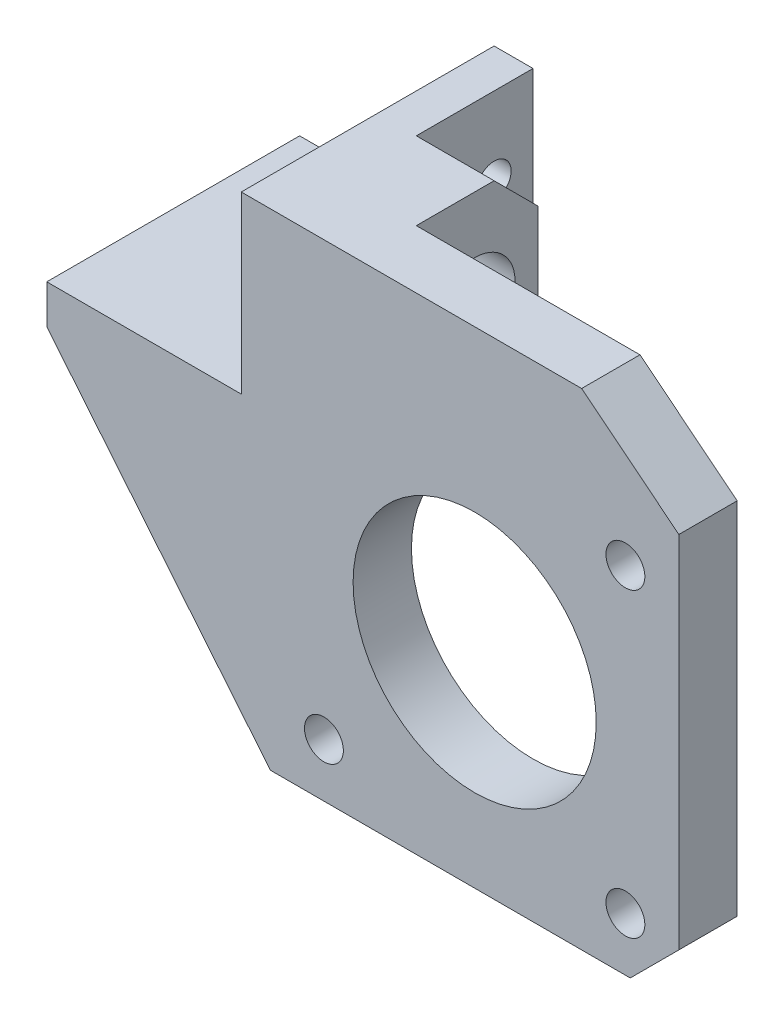
ISO-10303-21;
HEADER;
FILE_DESCRIPTION(('STEP AP214'),'2;1');
FILE_NAME('part.step','',(''),(''),'','','');
FILE_SCHEMA(('AUTOMOTIVE_DESIGN { 1 0 10303 214 1 1 1 1 }'));
ENDSEC;
DATA;
#1=APPLICATION_CONTEXT('core data for automotive mechanical design processes');
#2=APPLICATION_PROTOCOL_DEFINITION('international standard','automotive_design',2000,#1);
#3=PRODUCT_CONTEXT('',#1,'mechanical');
#4=PRODUCT('Part','Part','',(#3));
#5=PRODUCT_RELATED_PRODUCT_CATEGORY('part','',(#4));
#6=PRODUCT_DEFINITION_FORMATION('','',#4);
#7=PRODUCT_DEFINITION_CONTEXT('part definition',#1,'design');
#8=PRODUCT_DEFINITION('design','',#6,#7);
#9=PRODUCT_DEFINITION_SHAPE('','',#8);
#10=(LENGTH_UNIT() NAMED_UNIT(*) SI_UNIT(.MILLI.,.METRE.));
#11=(NAMED_UNIT(*) PLANE_ANGLE_UNIT() SI_UNIT($,.RADIAN.));
#12=(NAMED_UNIT(*) SI_UNIT($,.STERADIAN.) SOLID_ANGLE_UNIT());
#13=UNCERTAINTY_MEASURE_WITH_UNIT(LENGTH_MEASURE(1.E-05),#10,'distance_accuracy_value','');
#14=(GEOMETRIC_REPRESENTATION_CONTEXT(3) GLOBAL_UNCERTAINTY_ASSIGNED_CONTEXT((#13)) GLOBAL_UNIT_ASSIGNED_CONTEXT((#10,
#11,#12)) REPRESENTATION_CONTEXT('',''));
#15=CARTESIAN_POINT('',(0.,0.,0.));
#16=DIRECTION('',(0.,0.,1.));
#17=DIRECTION('',(1.,0.,0.));
#18=AXIS2_PLACEMENT_3D('',#15,#16,#17);
#19=CARTESIAN_POINT('',(-34.5,19.,-13.));
#20=DIRECTION('',(0.,-1.,0.));
#21=DIRECTION('',(1.,0.,0.));
#22=AXIS2_PLACEMENT_3D('',#19,#20,#21);
#23=CYLINDRICAL_SURFACE('',#22,1.75);
#24=CARTESIAN_POINT('',(-34.5,6.99999999999996,-13.));
#25=DIRECTION('',(0.,-1.,0.));
#26=DIRECTION('',(1.,0.,0.));
#27=AXIS2_PLACEMENT_3D('',#24,#25,#26);
#28=CIRCLE('',#27,1.75);
#29=CARTESIAN_POINT('',(-32.75,6.99999999999996,-13.));
#30=VERTEX_POINT('',#29);
#31=EDGE_CURVE('E304',#30,#30,#28,.T.);
#32=ORIENTED_EDGE('',*,*,#31,.T.);
#33=EDGE_LOOP('',(#32));
#34=FACE_BOUND('',#33,.T.);
#35=CARTESIAN_POINT('',(-34.5,9.99999999999995,-13.));
#36=DIRECTION('',(0.,1.,0.));
#37=DIRECTION('',(-1.,0.,0.));
#38=AXIS2_PLACEMENT_3D('',#35,#36,#37);
#39=CIRCLE('',#38,1.75);
#40=CARTESIAN_POINT('',(-36.25,9.99999999999995,-13.));
#41=VERTEX_POINT('',#40);
#42=EDGE_CURVE('E37',#41,#41,#39,.F.);
#43=ORIENTED_EDGE('',*,*,#42,.F.);
#44=EDGE_LOOP('',(#43));
#45=FACE_BOUND('',#44,.T.);
#46=ADVANCED_FACE('F33',(#34,#45),#23,.F.);
#47=CARTESIAN_POINT('',(-32.,21.,-16.));
#48=DIRECTION('',(1.,0.,0.));
#49=DIRECTION('',(0.,1.,0.));
#50=AXIS2_PLACEMENT_3D('',#47,#48,#49);
#51=CYLINDRICAL_SURFACE('',#50,1.75);
#52=CARTESIAN_POINT('',(-20.,21.,-16.));
#53=DIRECTION('',(1.,0.,0.));
#54=DIRECTION('',(0.,1.,0.));
#55=AXIS2_PLACEMENT_3D('',#52,#53,#54);
#56=CIRCLE('',#55,1.75);
#57=CARTESIAN_POINT('',(-20.,22.75,-16.));
#58=VERTEX_POINT('',#57);
#59=EDGE_CURVE('E303',#58,#58,#56,.T.);
#60=ORIENTED_EDGE('',*,*,#59,.T.);
#61=EDGE_LOOP('',(#60));
#62=FACE_BOUND('',#61,.T.);
#63=CARTESIAN_POINT('',(-23.,21.,-16.));
#64=DIRECTION('',(-1.,0.,0.));
#65=DIRECTION('',(0.,0.,1.));
#66=AXIS2_PLACEMENT_3D('',#63,#64,#65);
#67=CIRCLE('',#66,1.75);
#68=CARTESIAN_POINT('',(-23.,21.,-14.25));
#69=VERTEX_POINT('',#68);
#70=EDGE_CURVE('E311',#69,#69,#67,.F.);
#71=ORIENTED_EDGE('',*,*,#70,.F.);
#72=EDGE_LOOP('',(#71));
#73=FACE_BOUND('',#72,.T.);
#74=ADVANCED_FACE('F458',(#62,#73),#51,.F.);
#75=CARTESIAN_POINT('',(0.,0.,0.));
#76=DIRECTION('',(0.,0.,-1.));
#77=DIRECTION('',(-1.,0.,0.));
#78=AXIS2_PLACEMENT_3D('',#75,#76,#77);
#79=PLANE('',#78);
#80=CARTESIAN_POINT('',(15.4999999999999,-15.5,0.));
#81=DIRECTION('',(0.,0.,1.));
#82=DIRECTION('',(-1.,0.,0.));
#83=AXIS2_PLACEMENT_3D('',#80,#81,#82);
#84=CIRCLE('',#83,2.);
#85=CARTESIAN_POINT('',(13.4999999999999,-15.5,0.));
#86=VERTEX_POINT('',#85);
#87=EDGE_CURVE('E234',#86,#86,#84,.T.);
#88=ORIENTED_EDGE('',*,*,#87,.T.);
#89=EDGE_LOOP('',(#88));
#90=FACE_BOUND('',#89,.T.);
#91=CARTESIAN_POINT('',(0.,0.,0.));
#92=DIRECTION('',(0.,0.,1.));
#93=DIRECTION('',(1.,0.,0.));
#94=AXIS2_PLACEMENT_3D('',#91,#92,#93);
#95=CIRCLE('',#94,12.5);
#96=CARTESIAN_POINT('',(12.5,0.,0.));
#97=VERTEX_POINT('',#96);
#98=EDGE_CURVE('E246',#97,#97,#95,.T.);
#99=ORIENTED_EDGE('',*,*,#98,.T.);
#100=EDGE_LOOP('',(#99));
#101=FACE_BOUND('',#100,.T.);
#102=CARTESIAN_POINT('',(15.4999999999999,15.5,0.));
#103=DIRECTION('',(0.,0.,1.));
#104=DIRECTION('',(-1.,0.,0.));
#105=AXIS2_PLACEMENT_3D('',#102,#103,#104);
#106=CIRCLE('',#105,2.);
#107=CARTESIAN_POINT('',(13.4999999999999,15.5,0.));
#108=VERTEX_POINT('',#107);
#109=EDGE_CURVE('E240',#108,#108,#106,.T.);
#110=ORIENTED_EDGE('',*,*,#109,.T.);
#111=EDGE_LOOP('',(#110));
#112=FACE_BOUND('',#111,.T.);
#113=CARTESIAN_POINT('',(-15.5,-15.5,0.));
#114=DIRECTION('',(0.,0.,1.));
#115=DIRECTION('',(-1.,0.,0.));
#116=AXIS2_PLACEMENT_3D('',#113,#114,#115);
#117=CIRCLE('',#116,2.);
#118=CARTESIAN_POINT('',(-17.5,-15.5,0.));
#119=VERTEX_POINT('',#118);
#120=EDGE_CURVE('E230',#119,#119,#117,.T.);
#121=ORIENTED_EDGE('',*,*,#120,.T.);
#122=EDGE_LOOP('',(#121));
#123=FACE_BOUND('',#122,.T.);
#124=DIRECTION('',(0.,1.,0.));
#125=VECTOR('',#124,1.);
#126=CARTESIAN_POINT('',(21.,-21.,0.));
#127=LINE('',#126,#125);
#128=CARTESIAN_POINT('',(21.,-16.,0.));
#129=VERTEX_POINT('',#128);
#130=CARTESIAN_POINT('',(21.,21.,0.));
#131=VERTEX_POINT('',#130);
#132=EDGE_CURVE('E277',#129,#131,#127,.T.);
#133=ORIENTED_EDGE('',*,*,#132,.F.);
#134=DIRECTION('',(0.707106781186548,0.707106781186547,0.));
#135=VECTOR('',#134,1.);
#136=CARTESIAN_POINT('',(18.5,-18.5,0.));
#137=LINE('',#136,#135);
#138=CARTESIAN_POINT('',(16.,-21.,0.));
#139=VERTEX_POINT('',#138);
#140=EDGE_CURVE('E307',#129,#139,#137,.F.);
#141=ORIENTED_EDGE('',*,*,#140,.T.);
#142=DIRECTION('',(1.,0.,0.));
#143=VECTOR('',#142,1.);
#144=CARTESIAN_POINT('',(-21.,-21.,0.));
#145=LINE('',#144,#143);
#146=CARTESIAN_POINT('',(-21.,-21.,0.));
#147=VERTEX_POINT('',#146);
#148=EDGE_CURVE('E275',#147,#139,#145,.T.);
#149=ORIENTED_EDGE('',*,*,#148,.F.);
#150=DIRECTION('',(0.634739423360014,-0.772726254525234,0.));
#151=VECTOR('',#150,1.);
#152=CARTESIAN_POINT('',(-44.,6.99999999999996,0.));
#153=LINE('',#152,#151);
#154=CARTESIAN_POINT('',(-44.,6.99999999999996,0.));
#155=VERTEX_POINT('',#154);
#156=EDGE_CURVE('E252',#155,#147,#153,.T.);
#157=ORIENTED_EDGE('',*,*,#156,.F.);
#158=DIRECTION('',(-1.,0.,0.));
#159=VECTOR('',#158,1.);
#160=CARTESIAN_POINT('',(-44.,6.99999999999997,0.));
#161=LINE('',#160,#159);
#162=CARTESIAN_POINT('',(-24.,6.99999999999996,0.));
#163=VERTEX_POINT('',#162);
#164=EDGE_CURVE('E197',#163,#155,#161,.T.);
#165=ORIENTED_EDGE('',*,*,#164,.F.);
#166=CARTESIAN_POINT('',(-24.,11.,0.));
#167=DIRECTION('',(0.,0.,-1.));
#168=DIRECTION('',(-1.,0.,0.));
#169=AXIS2_PLACEMENT_3D('',#166,#167,#168);
#170=CIRCLE('',#169,3.99999999999999);
#171=CARTESIAN_POINT('',(-20.,11.,0.));
#172=VERTEX_POINT('',#171);
#173=EDGE_CURVE('E212',#172,#163,#170,.T.);
#174=ORIENTED_EDGE('',*,*,#173,.F.);
#175=DIRECTION('',(0.,-1.,0.));
#176=VECTOR('',#175,1.);
#177=CARTESIAN_POINT('',(-20.,9.,0.));
#178=LINE('',#177,#176);
#179=CARTESIAN_POINT('',(-20.,9.,0.));
#180=VERTEX_POINT('',#179);
#181=EDGE_CURVE('E328',#172,#180,#178,.T.);
#182=ORIENTED_EDGE('',*,*,#181,.T.);
#183=DIRECTION('',(-1.,0.,0.));
#184=VECTOR('',#183,1.);
#185=CARTESIAN_POINT('',(-12.,9.,0.));
#186=LINE('',#185,#184);
#187=CARTESIAN_POINT('',(-12.,9.,0.));
#188=VERTEX_POINT('',#187);
#189=EDGE_CURVE('E215',#188,#180,#186,.T.);
#190=ORIENTED_EDGE('',*,*,#189,.F.);
#191=DIRECTION('',(0.,-1.,0.));
#192=VECTOR('',#191,1.);
#193=CARTESIAN_POINT('',(-12.,9.,0.));
#194=LINE('',#193,#192);
#195=CARTESIAN_POINT('',(-12.,29.,0.));
#196=VERTEX_POINT('',#195);
#197=EDGE_CURVE('E329',#196,#188,#194,.T.);
#198=ORIENTED_EDGE('',*,*,#197,.F.);
#199=DIRECTION('',(-1.,0.,0.));
#200=VECTOR('',#199,1.);
#201=CARTESIAN_POINT('',(-24.,29.,0.));
#202=LINE('',#201,#200);
#203=CARTESIAN_POINT('',(11.,29.,0.));
#204=VERTEX_POINT('',#203);
#205=EDGE_CURVE('E259',#204,#196,#202,.T.);
#206=ORIENTED_EDGE('',*,*,#205,.F.);
#207=DIRECTION('',(-0.780868809443029,0.624695047554426,0.));
#208=VECTOR('',#207,1.);
#209=CARTESIAN_POINT('',(11.,29.,0.));
#210=LINE('',#209,#208);
#211=EDGE_CURVE('E279',#131,#204,#210,.T.);
#212=ORIENTED_EDGE('',*,*,#211,.F.);
#213=EDGE_LOOP('',(#133,#141,#149,#157,#165,#174,#182,#190,#198,#206,#212));
#214=FACE_BOUND('',#213,.T.);
#215=ADVANCED_FACE('F374',(#90,#101,#112,#123,#214),#79,.T.);
#216=CARTESIAN_POINT('',(0.,0.,6.));
#217=DIRECTION('',(0.,0.,-1.));
#218=DIRECTION('',(-1.,0.,0.));
#219=AXIS2_PLACEMENT_3D('',#216,#217,#218);
#220=PLANE('',#219);
#221=DIRECTION('',(1.,0.,0.));
#222=VECTOR('',#221,1.);
#223=CARTESIAN_POINT('',(-21.,-21.,6.));
#224=LINE('',#223,#222);
#225=CARTESIAN_POINT('',(-21.,-21.,6.));
#226=VERTEX_POINT('',#225);
#227=CARTESIAN_POINT('',(16.,-21.,6.));
#228=VERTEX_POINT('',#227);
#229=EDGE_CURVE('E265',#226,#228,#224,.T.);
#230=ORIENTED_EDGE('',*,*,#229,.T.);
#231=DIRECTION('',(-0.707106781186548,-0.707106781186547,0.));
#232=VECTOR('',#231,1.);
#233=CARTESIAN_POINT('',(21.,-16.,6.));
#234=LINE('',#233,#232);
#235=CARTESIAN_POINT('',(21.,-16.,6.));
#236=VERTEX_POINT('',#235);
#237=EDGE_CURVE('E186',#228,#236,#234,.F.);
#238=ORIENTED_EDGE('',*,*,#237,.T.);
#239=DIRECTION('',(0.,1.,0.));
#240=VECTOR('',#239,1.);
#241=CARTESIAN_POINT('',(21.,-21.,6.));
#242=LINE('',#241,#240);
#243=CARTESIAN_POINT('',(21.,21.,6.));
#244=VERTEX_POINT('',#243);
#245=EDGE_CURVE('E267',#236,#244,#242,.T.);
#246=ORIENTED_EDGE('',*,*,#245,.T.);
#247=DIRECTION('',(-0.780868809443029,0.624695047554426,0.));
#248=VECTOR('',#247,1.);
#249=CARTESIAN_POINT('',(11.,29.,6.));
#250=LINE('',#249,#248);
#251=CARTESIAN_POINT('',(11.,29.,6.));
#252=VERTEX_POINT('',#251);
#253=EDGE_CURVE('E269',#244,#252,#250,.T.);
#254=ORIENTED_EDGE('',*,*,#253,.T.);
#255=DIRECTION('',(-1.,0.,0.));
#256=VECTOR('',#255,1.);
#257=CARTESIAN_POINT('',(-24.,29.,6.));
#258=LINE('',#257,#256);
#259=CARTESIAN_POINT('',(-24.,29.,6.));
#260=VERTEX_POINT('',#259);
#261=EDGE_CURVE('E271',#252,#260,#258,.T.);
#262=ORIENTED_EDGE('',*,*,#261,.T.);
#263=DIRECTION('',(0.,-1.,0.));
#264=VECTOR('',#263,1.);
#265=CARTESIAN_POINT('',(-24.,11.,6.));
#266=LINE('',#265,#264);
#267=CARTESIAN_POINT('',(-24.,11.,6.));
#268=VERTEX_POINT('',#267);
#269=EDGE_CURVE('E255',#260,#268,#266,.T.);
#270=ORIENTED_EDGE('',*,*,#269,.T.);
#271=DIRECTION('',(-1.,0.,0.));
#272=VECTOR('',#271,1.);
#273=CARTESIAN_POINT('',(-24.,11.,6.));
#274=LINE('',#273,#272);
#275=CARTESIAN_POINT('',(-44.,10.9999999999999,6.));
#276=VERTEX_POINT('',#275);
#277=EDGE_CURVE('E258',#268,#276,#274,.T.);
#278=ORIENTED_EDGE('',*,*,#277,.T.);
#279=DIRECTION('',(0.,-1.,0.));
#280=VECTOR('',#279,1.);
#281=CARTESIAN_POINT('',(-44.,10.9999999999999,6.));
#282=LINE('',#281,#280);
#283=CARTESIAN_POINT('',(-44.,6.99999999999996,6.));
#284=VERTEX_POINT('',#283);
#285=EDGE_CURVE('E261',#276,#284,#282,.T.);
#286=ORIENTED_EDGE('',*,*,#285,.T.);
#287=DIRECTION('',(0.634739423360014,-0.772726254525234,0.));
#288=VECTOR('',#287,1.);
#289=CARTESIAN_POINT('',(-44.,6.99999999999996,6.));
#290=LINE('',#289,#288);
#291=EDGE_CURVE('E263',#284,#226,#290,.T.);
#292=ORIENTED_EDGE('',*,*,#291,.T.);
#293=EDGE_LOOP('',(#230,#238,#246,#254,#262,#270,#278,#286,#292));
#294=FACE_BOUND('',#293,.T.);
#295=CARTESIAN_POINT('',(0.,0.,6.));
#296=DIRECTION('',(0.,0.,1.));
#297=DIRECTION('',(1.,0.,0.));
#298=AXIS2_PLACEMENT_3D('',#295,#296,#297);
#299=CIRCLE('',#298,12.5);
#300=CARTESIAN_POINT('',(12.5,0.,6.));
#301=VERTEX_POINT('',#300);
#302=EDGE_CURVE('E249',#301,#301,#299,.T.);
#303=ORIENTED_EDGE('',*,*,#302,.F.);
#304=EDGE_LOOP('',(#303));
#305=FACE_BOUND('',#304,.T.);
#306=CARTESIAN_POINT('',(15.4999999999999,15.5,6.));
#307=DIRECTION('',(0.,0.,1.));
#308=DIRECTION('',(-1.,0.,0.));
#309=AXIS2_PLACEMENT_3D('',#306,#307,#308);
#310=CIRCLE('',#309,2.);
#311=CARTESIAN_POINT('',(13.4999999999999,15.5,6.));
#312=VERTEX_POINT('',#311);
#313=EDGE_CURVE('E243',#312,#312,#310,.T.);
#314=ORIENTED_EDGE('',*,*,#313,.F.);
#315=EDGE_LOOP('',(#314));
#316=FACE_BOUND('',#315,.T.);
#317=CARTESIAN_POINT('',(15.4999999999999,-15.5,6.));
#318=DIRECTION('',(0.,0.,1.));
#319=DIRECTION('',(-1.,0.,0.));
#320=AXIS2_PLACEMENT_3D('',#317,#318,#319);
#321=CIRCLE('',#320,2.);
#322=CARTESIAN_POINT('',(13.4999999999999,-15.5,6.));
#323=VERTEX_POINT('',#322);
#324=EDGE_CURVE('E237',#323,#323,#321,.T.);
#325=ORIENTED_EDGE('',*,*,#324,.F.);
#326=EDGE_LOOP('',(#325));
#327=FACE_BOUND('',#326,.T.);
#328=CARTESIAN_POINT('',(-15.5,-15.5,6.));
#329=DIRECTION('',(0.,0.,1.));
#330=DIRECTION('',(-1.,0.,0.));
#331=AXIS2_PLACEMENT_3D('',#328,#329,#330);
#332=CIRCLE('',#331,2.);
#333=CARTESIAN_POINT('',(-17.5,-15.5,6.));
#334=VERTEX_POINT('',#333);
#335=EDGE_CURVE('E231',#334,#334,#332,.T.);
#336=ORIENTED_EDGE('',*,*,#335,.F.);
#337=EDGE_LOOP('',(#336));
#338=FACE_BOUND('',#337,.T.);
#339=ADVANCED_FACE('F422',(#294,#305,#316,#327,#338),#220,.F.);
#340=CARTESIAN_POINT('',(-24.,11.,6.));
#341=DIRECTION('',(0.,-1.,0.));
#342=DIRECTION('',(1.,0.,0.));
#343=AXIS2_PLACEMENT_3D('',#340,#341,#342);
#344=PLANE('',#343);
#345=CARTESIAN_POINT('',(-34.5,10.9999999999999,-13.));
#346=DIRECTION('',(0.,1.,0.));
#347=DIRECTION('',(-1.,0.,0.));
#348=AXIS2_PLACEMENT_3D('',#345,#346,#347);
#349=CIRCLE('',#348,5.25);
#350=CARTESIAN_POINT('',(-39.75,10.9999999999999,-13.));
#351=VERTEX_POINT('',#350);
#352=EDGE_CURVE('E318',#351,#351,#349,.T.);
#353=ORIENTED_EDGE('',*,*,#352,.F.);
#354=EDGE_LOOP('',(#353));
#355=FACE_BOUND('',#354,.T.);
#356=DIRECTION('',(0.,0.,-1.));
#357=VECTOR('',#356,1.);
#358=CARTESIAN_POINT('',(-24.,11.,6.));
#359=LINE('',#358,#357);
#360=CARTESIAN_POINT('',(-24.,11.,-20.));
#361=VERTEX_POINT('',#360);
#362=EDGE_CURVE('E297',#268,#361,#359,.T.);
#363=ORIENTED_EDGE('',*,*,#362,.T.);
#364=DIRECTION('',(1.,0.,0.));
#365=VECTOR('',#364,1.);
#366=CARTESIAN_POINT('',(-24.,11.,-20.));
#367=LINE('',#366,#365);
#368=CARTESIAN_POINT('',(-44.,11.,-20.));
#369=VERTEX_POINT('',#368);
#370=EDGE_CURVE('E193',#369,#361,#367,.T.);
#371=ORIENTED_EDGE('',*,*,#370,.F.);
#372=DIRECTION('',(0.,0.,-1.));
#373=VECTOR('',#372,1.);
#374=CARTESIAN_POINT('',(-44.,10.9999999999999,6.));
#375=LINE('',#374,#373);
#376=EDGE_CURVE('E295',#276,#369,#375,.T.);
#377=ORIENTED_EDGE('',*,*,#376,.F.);
#378=ORIENTED_EDGE('',*,*,#277,.F.);
#379=EDGE_LOOP('',(#363,#371,#377,#378));
#380=FACE_BOUND('',#379,.T.);
#381=ADVANCED_FACE('F441',(#355,#380),#344,.F.);
#382=CARTESIAN_POINT('',(-44.,10.9999999999999,6.));
#383=DIRECTION('',(1.,0.,0.));
#384=DIRECTION('',(0.,0.,-1.));
#385=AXIS2_PLACEMENT_3D('',#382,#383,#384);
#386=PLANE('',#385);
#387=ORIENTED_EDGE('',*,*,#376,.T.);
#388=DIRECTION('',(0.,1.,0.));
#389=VECTOR('',#388,1.);
#390=CARTESIAN_POINT('',(-44.,11.,-20.));
#391=LINE('',#390,#389);
#392=CARTESIAN_POINT('',(-44.,6.99999999999997,-20.));
#393=VERTEX_POINT('',#392);
#394=EDGE_CURVE('E208',#393,#369,#391,.T.);
#395=ORIENTED_EDGE('',*,*,#394,.F.);
#396=DIRECTION('',(0.,0.,1.));
#397=VECTOR('',#396,1.);
#398=CARTESIAN_POINT('',(-44.,6.99999999999997,-20.));
#399=LINE('',#398,#397);
#400=EDGE_CURVE('E211',#393,#155,#399,.T.);
#401=ORIENTED_EDGE('',*,*,#400,.T.);
#402=DIRECTION('',(0.,0.,-1.));
#403=VECTOR('',#402,1.);
#404=CARTESIAN_POINT('',(-44.,6.99999999999996,6.));
#405=LINE('',#404,#403);
#406=EDGE_CURVE('E293',#284,#155,#405,.T.);
#407=ORIENTED_EDGE('',*,*,#406,.F.);
#408=ORIENTED_EDGE('',*,*,#285,.F.);
#409=EDGE_LOOP('',(#387,#395,#401,#407,#408));
#410=FACE_BOUND('',#409,.T.);
#411=ADVANCED_FACE('F436',(#410),#386,.F.);
#412=CARTESIAN_POINT('',(-44.,6.99999999999996,6.));
#413=DIRECTION('',(0.772726254525234,0.634739423360014,0.));
#414=DIRECTION('',(-0.634739423360014,0.772726254525234,0.));
#415=AXIS2_PLACEMENT_3D('',#412,#413,#414);
#416=PLANE('',#415);
#417=ORIENTED_EDGE('',*,*,#156,.T.);
#418=DIRECTION('',(0.,0.,-1.));
#419=VECTOR('',#418,1.);
#420=CARTESIAN_POINT('',(-21.,-21.,6.));
#421=LINE('',#420,#419);
#422=EDGE_CURVE('E290',#226,#147,#421,.T.);
#423=ORIENTED_EDGE('',*,*,#422,.F.);
#424=ORIENTED_EDGE('',*,*,#291,.F.);
#425=ORIENTED_EDGE('',*,*,#406,.T.);
#426=EDGE_LOOP('',(#417,#423,#424,#425));
#427=FACE_BOUND('',#426,.T.);
#428=ADVANCED_FACE('F521',(#427),#416,.F.);
#429=CARTESIAN_POINT('',(-21.,-21.,6.));
#430=DIRECTION('',(0.,1.,0.));
#431=DIRECTION('',(0.,0.,1.));
#432=AXIS2_PLACEMENT_3D('',#429,#430,#431);
#433=PLANE('',#432);
#434=ORIENTED_EDGE('',*,*,#148,.T.);
#435=DIRECTION('',(0.,0.,1.));
#436=VECTOR('',#435,1.);
#437=CARTESIAN_POINT('',(16.,-21.,6.));
#438=LINE('',#437,#436);
#439=EDGE_CURVE('E56',#139,#228,#438,.T.);
#440=ORIENTED_EDGE('',*,*,#439,.T.);
#441=ORIENTED_EDGE('',*,*,#229,.F.);
#442=ORIENTED_EDGE('',*,*,#422,.T.);
#443=EDGE_LOOP('',(#434,#440,#441,#442));
#444=FACE_BOUND('',#443,.T.);
#445=ADVANCED_FACE('F426',(#444),#433,.F.);
#446=CARTESIAN_POINT('',(21.,-21.,6.));
#447=DIRECTION('',(-1.,0.,0.));
#448=DIRECTION('',(0.,-1.,0.));
#449=AXIS2_PLACEMENT_3D('',#446,#447,#448);
#450=PLANE('',#449);
#451=ORIENTED_EDGE('',*,*,#245,.F.);
#452=DIRECTION('',(0.,0.,-1.));
#453=VECTOR('',#452,1.);
#454=CARTESIAN_POINT('',(21.,-16.,6.));
#455=LINE('',#454,#453);
#456=EDGE_CURVE('E299',#236,#129,#455,.T.);
#457=ORIENTED_EDGE('',*,*,#456,.T.);
#458=ORIENTED_EDGE('',*,*,#132,.T.);
#459=DIRECTION('',(0.,0.,-1.));
#460=VECTOR('',#459,1.);
#461=CARTESIAN_POINT('',(21.,21.,6.));
#462=LINE('',#461,#460);
#463=EDGE_CURVE('E287',#244,#131,#462,.T.);
#464=ORIENTED_EDGE('',*,*,#463,.F.);
#465=EDGE_LOOP('',(#451,#457,#458,#464));
#466=FACE_BOUND('',#465,.T.);
#467=ADVANCED_FACE('F417',(#466),#450,.F.);
#468=CARTESIAN_POINT('',(11.,29.,6.));
#469=DIRECTION('',(-0.624695047554426,-0.780868809443029,0.));
#470=DIRECTION('',(0.780868809443029,-0.624695047554426,0.));
#471=AXIS2_PLACEMENT_3D('',#468,#469,#470);
#472=PLANE('',#471);
#473=ORIENTED_EDGE('',*,*,#211,.T.);
#474=DIRECTION('',(0.,0.,-1.));
#475=VECTOR('',#474,1.);
#476=CARTESIAN_POINT('',(11.,29.,6.));
#477=LINE('',#476,#475);
#478=EDGE_CURVE('E284',#252,#204,#477,.T.);
#479=ORIENTED_EDGE('',*,*,#478,.F.);
#480=ORIENTED_EDGE('',*,*,#253,.F.);
#481=ORIENTED_EDGE('',*,*,#463,.T.);
#482=EDGE_LOOP('',(#473,#479,#480,#481));
#483=FACE_BOUND('',#482,.T.);
#484=ADVANCED_FACE('F412',(#483),#472,.F.);
#485=CARTESIAN_POINT('',(-24.,29.,6.));
#486=DIRECTION('',(0.,-1.,0.));
#487=DIRECTION('',(1.,0.,0.));
#488=AXIS2_PLACEMENT_3D('',#485,#486,#487);
#489=PLANE('',#488);
#490=ORIENTED_EDGE('',*,*,#205,.T.);
#491=DIRECTION('',(0.,0.,1.));
#492=VECTOR('',#491,1.);
#493=CARTESIAN_POINT('',(-12.,29.,0.));
#494=LINE('',#493,#492);
#495=CARTESIAN_POINT('',(-12.,29.,-8.));
#496=VERTEX_POINT('',#495);
#497=EDGE_CURVE('E341',#496,#196,#494,.T.);
#498=ORIENTED_EDGE('',*,*,#497,.F.);
#499=DIRECTION('',(-1.,0.,0.));
#500=VECTOR('',#499,1.);
#501=CARTESIAN_POINT('',(-12.,29.,-8.));
#502=LINE('',#501,#500);
#503=CARTESIAN_POINT('',(-20.,29.,-8.));
#504=VERTEX_POINT('',#503);
#505=EDGE_CURVE('E343',#496,#504,#502,.T.);
#506=ORIENTED_EDGE('',*,*,#505,.T.);
#507=DIRECTION('',(0.,0.,1.));
#508=VECTOR('',#507,1.);
#509=CARTESIAN_POINT('',(-20.,29.,-20.));
#510=LINE('',#509,#508);
#511=CARTESIAN_POINT('',(-20.,29.,-20.));
#512=VERTEX_POINT('',#511);
#513=EDGE_CURVE('E227',#512,#504,#510,.T.);
#514=ORIENTED_EDGE('',*,*,#513,.F.);
#515=DIRECTION('',(1.,0.,0.));
#516=VECTOR('',#515,1.);
#517=CARTESIAN_POINT('',(-20.,29.,-20.));
#518=LINE('',#517,#516);
#519=CARTESIAN_POINT('',(-24.,29.,-20.));
#520=VERTEX_POINT('',#519);
#521=EDGE_CURVE('E195',#520,#512,#518,.T.);
#522=ORIENTED_EDGE('',*,*,#521,.F.);
#523=DIRECTION('',(0.,0.,-1.));
#524=VECTOR('',#523,1.);
#525=CARTESIAN_POINT('',(-24.,29.,6.));
#526=LINE('',#525,#524);
#527=EDGE_CURVE('E190',#260,#520,#526,.T.);
#528=ORIENTED_EDGE('',*,*,#527,.F.);
#529=ORIENTED_EDGE('',*,*,#261,.F.);
#530=ORIENTED_EDGE('',*,*,#478,.T.);
#531=EDGE_LOOP('',(#490,#498,#506,#514,#522,#528,#529,#530));
#532=FACE_BOUND('',#531,.T.);
#533=ADVANCED_FACE('F407',(#532),#489,.F.);
#534=CARTESIAN_POINT('',(-24.,21.,6.));
#535=DIRECTION('',(1.,0.,0.));
#536=DIRECTION('',(0.,0.,-1.));
#537=AXIS2_PLACEMENT_3D('',#534,#535,#536);
#538=PLANE('',#537);
#539=CARTESIAN_POINT('',(-24.,19.,-6.));
#540=DIRECTION('',(1.,0.,0.));
#541=DIRECTION('',(0.,0.,-1.));
#542=AXIS2_PLACEMENT_3D('',#539,#540,#541);
#543=CIRCLE('',#542,4.15);
#544=CARTESIAN_POINT('',(-24.,19.,-10.15));
#545=VERTEX_POINT('',#544);
#546=EDGE_CURVE('E300',#545,#545,#543,.T.);
#547=ORIENTED_EDGE('',*,*,#546,.T.);
#548=EDGE_LOOP('',(#547));
#549=FACE_BOUND('',#548,.T.);
#550=DIRECTION('',(0.,1.,0.));
#551=VECTOR('',#550,1.);
#552=CARTESIAN_POINT('',(-24.,29.,-20.));
#553=LINE('',#552,#551);
#554=CARTESIAN_POINT('',(-24.,24.4003676271839,-20.));
#555=VERTEX_POINT('',#554);
#556=EDGE_CURVE('E183',#555,#520,#553,.T.);
#557=ORIENTED_EDGE('',*,*,#556,.F.);
#558=CARTESIAN_POINT('',(-24.,21.,-16.));
#559=DIRECTION('',(-1.,0.,0.));
#560=DIRECTION('',(0.,0.,1.));
#561=AXIS2_PLACEMENT_3D('',#558,#559,#560);
#562=CIRCLE('',#561,5.25);
#563=CARTESIAN_POINT('',(-24.,17.5996323728161,-20.));
#564=VERTEX_POINT('',#563);
#565=EDGE_CURVE('E171',#564,#555,#562,.T.);
#566=ORIENTED_EDGE('',*,*,#565,.F.);
#567=EDGE_CURVE('E192',#361,#564,#553,.T.);
#568=ORIENTED_EDGE('',*,*,#567,.F.);
#569=ORIENTED_EDGE('',*,*,#362,.F.);
#570=ORIENTED_EDGE('',*,*,#269,.F.);
#571=ORIENTED_EDGE('',*,*,#527,.T.);
#572=EDGE_LOOP('',(#557,#566,#568,#569,#570,#571));
#573=FACE_BOUND('',#572,.T.);
#574=ADVANCED_FACE('F188',(#549,#573),#538,.F.);
#575=CARTESIAN_POINT('',(0.,0.,6.));
#576=DIRECTION('',(0.,0.,-1.));
#577=DIRECTION('',(-1.,0.,0.));
#578=AXIS2_PLACEMENT_3D('',#575,#576,#577);
#579=CYLINDRICAL_SURFACE('',#578,12.5);
#580=ORIENTED_EDGE('',*,*,#302,.T.);
#581=EDGE_LOOP('',(#580));
#582=FACE_BOUND('',#581,.T.);
#583=ORIENTED_EDGE('',*,*,#98,.F.);
#584=EDGE_LOOP('',(#583));
#585=FACE_BOUND('',#584,.T.);
#586=ADVANCED_FACE('F500',(#582,#585),#579,.F.);
#587=CARTESIAN_POINT('',(15.4999999999999,15.5,6.));
#588=DIRECTION('',(0.,0.,-1.));
#589=DIRECTION('',(-1.,0.,0.));
#590=AXIS2_PLACEMENT_3D('',#587,#588,#589);
#591=CYLINDRICAL_SURFACE('',#590,2.);
#592=ORIENTED_EDGE('',*,*,#313,.T.);
#593=EDGE_LOOP('',(#592));
#594=FACE_BOUND('',#593,.T.);
#595=ORIENTED_EDGE('',*,*,#109,.F.);
#596=EDGE_LOOP('',(#595));
#597=FACE_BOUND('',#596,.T.);
#598=ADVANCED_FACE('F496',(#594,#597),#591,.F.);
#599=CARTESIAN_POINT('',(15.4999999999999,-15.5,6.));
#600=DIRECTION('',(0.,0.,-1.));
#601=DIRECTION('',(-1.,0.,0.));
#602=AXIS2_PLACEMENT_3D('',#599,#600,#601);
#603=CYLINDRICAL_SURFACE('',#602,2.);
#604=ORIENTED_EDGE('',*,*,#324,.T.);
#605=EDGE_LOOP('',(#604));
#606=FACE_BOUND('',#605,.T.);
#607=ORIENTED_EDGE('',*,*,#87,.F.);
#608=EDGE_LOOP('',(#607));
#609=FACE_BOUND('',#608,.T.);
#610=ADVANCED_FACE('F492',(#606,#609),#603,.F.);
#611=CARTESIAN_POINT('',(-15.5,-15.5,6.));
#612=DIRECTION('',(0.,0.,-1.));
#613=DIRECTION('',(-1.,0.,0.));
#614=AXIS2_PLACEMENT_3D('',#611,#612,#613);
#615=CYLINDRICAL_SURFACE('',#614,2.);
#616=ORIENTED_EDGE('',*,*,#335,.T.);
#617=EDGE_LOOP('',(#616));
#618=FACE_BOUND('',#617,.T.);
#619=ORIENTED_EDGE('',*,*,#120,.F.);
#620=EDGE_LOOP('',(#619));
#621=FACE_BOUND('',#620,.T.);
#622=ADVANCED_FACE('F488',(#618,#621),#615,.F.);
#623=CARTESIAN_POINT('',(-20.,11.,-20.));
#624=DIRECTION('',(-1.,0.,0.));
#625=DIRECTION('',(0.,-1.,0.));
#626=AXIS2_PLACEMENT_3D('',#623,#624,#625);
#627=PLANE('',#626);
#628=ORIENTED_EDGE('',*,*,#59,.F.);
#629=EDGE_LOOP('',(#628));
#630=FACE_BOUND('',#629,.T.);
#631=DIRECTION('',(0.,0.707106781186548,-0.707106781186547));
#632=VECTOR('',#631,1.);
#633=CARTESIAN_POINT('',(-20.,13.5,-12.5));
#634=LINE('',#633,#632);
#635=CARTESIAN_POINT('',(-20.,10.9999999999999,-9.99999999999995));
#636=VERTEX_POINT('',#635);
#637=CARTESIAN_POINT('',(-20.,13.5,-12.5));
#638=VERTEX_POINT('',#637);
#639=EDGE_CURVE('E348',#636,#638,#634,.T.);
#640=ORIENTED_EDGE('',*,*,#639,.F.);
#641=DIRECTION('',(0.,0.,1.));
#642=VECTOR('',#641,1.);
#643=CARTESIAN_POINT('',(-20.,11.,-20.));
#644=LINE('',#643,#642);
#645=CARTESIAN_POINT('',(-20.,11.,-20.));
#646=VERTEX_POINT('',#645);
#647=EDGE_CURVE('E224',#646,#636,#644,.T.);
#648=ORIENTED_EDGE('',*,*,#647,.F.);
#649=DIRECTION('',(0.,-1.,0.));
#650=VECTOR('',#649,1.);
#651=CARTESIAN_POINT('',(-20.,11.,-20.));
#652=LINE('',#651,#650);
#653=EDGE_CURVE('E202',#512,#646,#652,.T.);
#654=ORIENTED_EDGE('',*,*,#653,.F.);
#655=ORIENTED_EDGE('',*,*,#513,.T.);
#656=DIRECTION('',(0.,0.707106781186548,0.707106781186547));
#657=VECTOR('',#656,1.);
#658=CARTESIAN_POINT('',(-20.,29.,-8.));
#659=LINE('',#658,#657);
#660=CARTESIAN_POINT('',(-20.,24.5,-12.5));
#661=VERTEX_POINT('',#660);
#662=EDGE_CURVE('E333',#661,#504,#659,.T.);
#663=ORIENTED_EDGE('',*,*,#662,.F.);
#664=DIRECTION('',(0.,1.,0.));
#665=VECTOR('',#664,1.);
#666=CARTESIAN_POINT('',(-20.,24.5,-12.5));
#667=LINE('',#666,#665);
#668=EDGE_CURVE('E352',#638,#661,#667,.T.);
#669=ORIENTED_EDGE('',*,*,#668,.F.);
#670=EDGE_LOOP('',(#640,#648,#654,#655,#663,#669));
#671=FACE_BOUND('',#670,.T.);
#672=ADVANCED_FACE('F387',(#630,#671),#627,.F.);
#673=CARTESIAN_POINT('',(-24.,11.,-20.));
#674=DIRECTION('',(0.,0.,1.));
#675=DIRECTION('',(1.,0.,0.));
#676=AXIS2_PLACEMENT_3D('',#673,#674,#675);
#677=CYLINDRICAL_SURFACE('',#676,3.99999999999999);
#678=ORIENTED_EDGE('',*,*,#173,.T.);
#679=DIRECTION('',(0.,0.,1.));
#680=VECTOR('',#679,1.);
#681=CARTESIAN_POINT('',(-24.,6.99999999999996,-20.));
#682=LINE('',#681,#680);
#683=CARTESIAN_POINT('',(-24.,6.99999999999996,-20.));
#684=VERTEX_POINT('',#683);
#685=EDGE_CURVE('E220',#684,#163,#682,.T.);
#686=ORIENTED_EDGE('',*,*,#685,.F.);
#687=CARTESIAN_POINT('',(-24.,11.,-20.));
#688=DIRECTION('',(0.,0.,-1.));
#689=DIRECTION('',(-1.,0.,0.));
#690=AXIS2_PLACEMENT_3D('',#687,#688,#689);
#691=CIRCLE('',#690,3.99999999999999);
#692=EDGE_CURVE('E204',#646,#684,#691,.T.);
#693=ORIENTED_EDGE('',*,*,#692,.F.);
#694=ORIENTED_EDGE('',*,*,#647,.T.);
#695=EDGE_CURVE('E223',#636,#172,#644,.T.);
#696=ORIENTED_EDGE('',*,*,#695,.T.);
#697=EDGE_LOOP('',(#678,#686,#693,#694,#696));
#698=FACE_BOUND('',#697,.T.);
#699=ADVANCED_FACE('F380',(#698),#677,.T.);
#700=CARTESIAN_POINT('',(-44.,6.99999999999997,-20.));
#701=DIRECTION('',(0.,1.,0.));
#702=DIRECTION('',(-1.,0.,0.));
#703=AXIS2_PLACEMENT_3D('',#700,#701,#702);
#704=PLANE('',#703);
#705=ORIENTED_EDGE('',*,*,#31,.F.);
#706=EDGE_LOOP('',(#705));
#707=FACE_BOUND('',#706,.T.);
#708=ORIENTED_EDGE('',*,*,#164,.T.);
#709=ORIENTED_EDGE('',*,*,#400,.F.);
#710=DIRECTION('',(-1.,0.,0.));
#711=VECTOR('',#710,1.);
#712=CARTESIAN_POINT('',(-44.,6.99999999999997,-20.));
#713=LINE('',#712,#711);
#714=EDGE_CURVE('E206',#684,#393,#713,.T.);
#715=ORIENTED_EDGE('',*,*,#714,.F.);
#716=ORIENTED_EDGE('',*,*,#685,.T.);
#717=EDGE_LOOP('',(#708,#709,#715,#716));
#718=FACE_BOUND('',#717,.T.);
#719=ADVANCED_FACE('F431',(#707,#718),#704,.F.);
#720=CARTESIAN_POINT('',(-24.,11.,-20.));
#721=DIRECTION('',(0.,0.,-1.));
#722=DIRECTION('',(-1.,0.,0.));
#723=AXIS2_PLACEMENT_3D('',#720,#721,#722);
#724=PLANE('',#723);
#725=DIRECTION('',(-1.,0.,0.));
#726=VECTOR('',#725,1.);
#727=CARTESIAN_POINT('',(-23.,17.5996323728161,-20.));
#728=LINE('',#727,#726);
#729=CARTESIAN_POINT('',(-23.,17.5996323728161,-20.));
#730=VERTEX_POINT('',#729);
#731=EDGE_CURVE('E11',#730,#564,#728,.T.);
#732=ORIENTED_EDGE('',*,*,#731,.F.);
#733=DIRECTION('',(0.,1.,0.));
#734=VECTOR('',#733,1.);
#735=CARTESIAN_POINT('',(-23.,11.,-20.));
#736=LINE('',#735,#734);
#737=CARTESIAN_POINT('',(-23.,24.4003676271839,-20.));
#738=VERTEX_POINT('',#737);
#739=EDGE_CURVE('E185',#730,#738,#736,.T.);
#740=ORIENTED_EDGE('',*,*,#739,.T.);
#741=DIRECTION('',(-1.,0.,0.));
#742=VECTOR('',#741,1.);
#743=CARTESIAN_POINT('',(-23.,24.4003676271839,-20.));
#744=LINE('',#743,#742);
#745=EDGE_CURVE('E42',#555,#738,#744,.F.);
#746=ORIENTED_EDGE('',*,*,#745,.F.);
#747=ORIENTED_EDGE('',*,*,#556,.T.);
#748=ORIENTED_EDGE('',*,*,#521,.T.);
#749=ORIENTED_EDGE('',*,*,#653,.T.);
#750=ORIENTED_EDGE('',*,*,#692,.T.);
#751=ORIENTED_EDGE('',*,*,#714,.T.);
#752=ORIENTED_EDGE('',*,*,#394,.T.);
#753=ORIENTED_EDGE('',*,*,#370,.T.);
#754=ORIENTED_EDGE('',*,*,#567,.T.);
#755=EDGE_LOOP('',(#732,#740,#746,#747,#748,#749,#750,#751,#752,#753,#754));
#756=FACE_BOUND('',#755,.T.);
#757=ADVANCED_FACE('F182',(#756),#724,.T.);
#758=CARTESIAN_POINT('',(-20.,0.,0.));
#759=DIRECTION('',(-1.,0.,0.));
#760=DIRECTION('',(0.,-1.,0.));
#761=AXIS2_PLACEMENT_3D('',#758,#759,#760);
#762=PLANE('',#761);
#763=ORIENTED_EDGE('',*,*,#695,.F.);
#764=CARTESIAN_POINT('',(-20.,9.,-8.));
#765=VERTEX_POINT('',#764);
#766=EDGE_CURVE('E349',#765,#636,#634,.T.);
#767=ORIENTED_EDGE('',*,*,#766,.F.);
#768=DIRECTION('',(0.,0.,-1.));
#769=VECTOR('',#768,1.);
#770=CARTESIAN_POINT('',(-20.,9.,-8.));
#771=LINE('',#770,#769);
#772=EDGE_CURVE('E346',#180,#765,#771,.T.);
#773=ORIENTED_EDGE('',*,*,#772,.F.);
#774=ORIENTED_EDGE('',*,*,#181,.F.);
#775=EDGE_LOOP('',(#763,#767,#773,#774));
#776=FACE_BOUND('',#775,.T.);
#777=ADVANCED_FACE('F377',(#776),#762,.T.);
#778=CARTESIAN_POINT('',(-12.,0.,0.));
#779=DIRECTION('',(-1.,0.,0.));
#780=DIRECTION('',(0.,-1.,0.));
#781=AXIS2_PLACEMENT_3D('',#778,#779,#780);
#782=PLANE('',#781);
#783=ORIENTED_EDGE('',*,*,#197,.T.);
#784=DIRECTION('',(0.,0.,-1.));
#785=VECTOR('',#784,1.);
#786=CARTESIAN_POINT('',(-12.,9.,-8.));
#787=LINE('',#786,#785);
#788=CARTESIAN_POINT('',(-12.,9.,-8.));
#789=VERTEX_POINT('',#788);
#790=EDGE_CURVE('E332',#188,#789,#787,.T.);
#791=ORIENTED_EDGE('',*,*,#790,.T.);
#792=DIRECTION('',(0.,0.707106781186548,-0.707106781186547));
#793=VECTOR('',#792,1.);
#794=CARTESIAN_POINT('',(-12.,13.5,-12.5));
#795=LINE('',#794,#793);
#796=CARTESIAN_POINT('',(-12.,13.5,-12.5));
#797=VERTEX_POINT('',#796);
#798=EDGE_CURVE('E335',#789,#797,#795,.T.);
#799=ORIENTED_EDGE('',*,*,#798,.T.);
#800=DIRECTION('',(0.,1.,0.));
#801=VECTOR('',#800,1.);
#802=CARTESIAN_POINT('',(-12.,24.5,-12.5));
#803=LINE('',#802,#801);
#804=CARTESIAN_POINT('',(-12.,24.5,-12.5));
#805=VERTEX_POINT('',#804);
#806=EDGE_CURVE('E337',#797,#805,#803,.T.);
#807=ORIENTED_EDGE('',*,*,#806,.T.);
#808=DIRECTION('',(0.,0.707106781186548,0.707106781186547));
#809=VECTOR('',#808,1.);
#810=CARTESIAN_POINT('',(-12.,29.,-8.));
#811=LINE('',#810,#809);
#812=EDGE_CURVE('E339',#805,#496,#811,.T.);
#813=ORIENTED_EDGE('',*,*,#812,.T.);
#814=ORIENTED_EDGE('',*,*,#497,.T.);
#815=EDGE_LOOP('',(#783,#791,#799,#807,#813,#814));
#816=FACE_BOUND('',#815,.T.);
#817=CARTESIAN_POINT('',(-12.,19.,-6.));
#818=DIRECTION('',(1.,0.,0.));
#819=DIRECTION('',(0.,1.,0.));
#820=AXIS2_PLACEMENT_3D('',#817,#818,#819);
#821=CIRCLE('',#820,4.15);
#822=CARTESIAN_POINT('',(-12.,23.15,-6.));
#823=VERTEX_POINT('',#822);
#824=EDGE_CURVE('E325',#823,#823,#821,.T.);
#825=ORIENTED_EDGE('',*,*,#824,.F.);
#826=EDGE_LOOP('',(#825));
#827=FACE_BOUND('',#826,.T.);
#828=ADVANCED_FACE('F400',(#816,#827),#782,.F.);
#829=CARTESIAN_POINT('',(-12.,9.,-8.));
#830=DIRECTION('',(0.,1.,0.));
#831=DIRECTION('',(0.,0.,1.));
#832=AXIS2_PLACEMENT_3D('',#829,#830,#831);
#833=PLANE('',#832);
#834=ORIENTED_EDGE('',*,*,#772,.T.);
#835=DIRECTION('',(-1.,0.,0.));
#836=VECTOR('',#835,1.);
#837=CARTESIAN_POINT('',(-12.,9.,-8.));
#838=LINE('',#837,#836);
#839=EDGE_CURVE('E363',#789,#765,#838,.T.);
#840=ORIENTED_EDGE('',*,*,#839,.F.);
#841=ORIENTED_EDGE('',*,*,#790,.F.);
#842=ORIENTED_EDGE('',*,*,#189,.T.);
#843=EDGE_LOOP('',(#834,#840,#841,#842));
#844=FACE_BOUND('',#843,.T.);
#845=ADVANCED_FACE('F368',(#844),#833,.F.);
#846=CARTESIAN_POINT('',(-12.,13.5,-12.5));
#847=DIRECTION('',(0.,0.707106781186547,0.707106781186548));
#848=DIRECTION('',(0.,-0.707106781186548,0.707106781186547));
#849=AXIS2_PLACEMENT_3D('',#846,#847,#848);
#850=PLANE('',#849);
#851=ORIENTED_EDGE('',*,*,#766,.T.);
#852=ORIENTED_EDGE('',*,*,#639,.T.);
#853=DIRECTION('',(-1.,0.,0.));
#854=VECTOR('',#853,1.);
#855=CARTESIAN_POINT('',(-12.,13.5,-12.5));
#856=LINE('',#855,#854);
#857=EDGE_CURVE('E360',#797,#638,#856,.T.);
#858=ORIENTED_EDGE('',*,*,#857,.F.);
#859=ORIENTED_EDGE('',*,*,#798,.F.);
#860=ORIENTED_EDGE('',*,*,#839,.T.);
#861=EDGE_LOOP('',(#851,#852,#858,#859,#860));
#862=FACE_BOUND('',#861,.T.);
#863=ADVANCED_FACE('F392',(#862),#850,.F.);
#864=CARTESIAN_POINT('',(-12.,24.5,-12.5));
#865=DIRECTION('',(0.,0.,1.));
#866=DIRECTION('',(1.,0.,0.));
#867=AXIS2_PLACEMENT_3D('',#864,#865,#866);
#868=PLANE('',#867);
#869=ORIENTED_EDGE('',*,*,#668,.T.);
#870=DIRECTION('',(-1.,0.,0.));
#871=VECTOR('',#870,1.);
#872=CARTESIAN_POINT('',(-12.,24.5,-12.5));
#873=LINE('',#872,#871);
#874=EDGE_CURVE('E357',#805,#661,#873,.T.);
#875=ORIENTED_EDGE('',*,*,#874,.F.);
#876=ORIENTED_EDGE('',*,*,#806,.F.);
#877=ORIENTED_EDGE('',*,*,#857,.T.);
#878=EDGE_LOOP('',(#869,#875,#876,#877));
#879=FACE_BOUND('',#878,.T.);
#880=ADVANCED_FACE('F396',(#879),#868,.F.);
#881=CARTESIAN_POINT('',(-12.,29.,-8.));
#882=DIRECTION('',(0.,-0.707106781186547,0.707106781186548));
#883=DIRECTION('',(0.,-0.707106781186548,-0.707106781186547));
#884=AXIS2_PLACEMENT_3D('',#881,#882,#883);
#885=PLANE('',#884);
#886=ORIENTED_EDGE('',*,*,#662,.T.);
#887=ORIENTED_EDGE('',*,*,#505,.F.);
#888=ORIENTED_EDGE('',*,*,#812,.F.);
#889=ORIENTED_EDGE('',*,*,#874,.T.);
#890=EDGE_LOOP('',(#886,#887,#888,#889));
#891=FACE_BOUND('',#890,.T.);
#892=ADVANCED_FACE('F445',(#891),#885,.F.);
#893=CARTESIAN_POINT('',(-12.,19.,-6.));
#894=DIRECTION('',(-1.,0.,0.));
#895=DIRECTION('',(0.,-1.,0.));
#896=AXIS2_PLACEMENT_3D('',#893,#894,#895);
#897=CYLINDRICAL_SURFACE('',#896,4.15);
#898=ORIENTED_EDGE('',*,*,#824,.T.);
#899=EDGE_LOOP('',(#898));
#900=FACE_BOUND('',#899,.T.);
#901=ORIENTED_EDGE('',*,*,#546,.F.);
#902=EDGE_LOOP('',(#901));
#903=FACE_BOUND('',#902,.T.);
#904=ADVANCED_FACE('F447',(#900,#903),#897,.F.);
#905=CARTESIAN_POINT('',(21.,-16.,6.));
#906=DIRECTION('',(-0.707106781186547,0.707106781186548,0.));
#907=DIRECTION('',(0.,0.,-1.));
#908=AXIS2_PLACEMENT_3D('',#905,#906,#907);
#909=PLANE('',#908);
#910=ORIENTED_EDGE('',*,*,#237,.F.);
#911=ORIENTED_EDGE('',*,*,#439,.F.);
#912=ORIENTED_EDGE('',*,*,#140,.F.);
#913=ORIENTED_EDGE('',*,*,#456,.F.);
#914=EDGE_LOOP('',(#910,#911,#912,#913));
#915=FACE_BOUND('',#914,.T.);
#916=ADVANCED_FACE('F35',(#915),#909,.F.);
#917=CARTESIAN_POINT('',(-23.,21.,-16.));
#918=DIRECTION('',(-1.,0.,0.));
#919=DIRECTION('',(0.,0.,1.));
#920=AXIS2_PLACEMENT_3D('',#917,#918,#919);
#921=PLANE('',#920);
#922=CARTESIAN_POINT('',(-23.,21.,-16.));
#923=DIRECTION('',(-1.,0.,0.));
#924=DIRECTION('',(0.,0.,1.));
#925=AXIS2_PLACEMENT_3D('',#922,#923,#924);
#926=CIRCLE('',#925,5.25);
#927=EDGE_CURVE('E48',#730,#738,#926,.T.);
#928=ORIENTED_EDGE('',*,*,#927,.T.);
#929=ORIENTED_EDGE('',*,*,#739,.F.);
#930=EDGE_LOOP('',(#928,#929));
#931=FACE_BOUND('',#930,.T.);
#932=ORIENTED_EDGE('',*,*,#70,.T.);
#933=EDGE_LOOP('',(#932));
#934=FACE_BOUND('',#933,.T.);
#935=ADVANCED_FACE('F549',(#931,#934),#921,.T.);
#936=CARTESIAN_POINT('',(-23.,21.,-16.));
#937=DIRECTION('',(-1.,0.,0.));
#938=DIRECTION('',(0.,0.,1.));
#939=AXIS2_PLACEMENT_3D('',#936,#937,#938);
#940=CYLINDRICAL_SURFACE('',#939,5.25);
#941=ORIENTED_EDGE('',*,*,#731,.T.);
#942=ORIENTED_EDGE('',*,*,#565,.T.);
#943=ORIENTED_EDGE('',*,*,#745,.T.);
#944=ORIENTED_EDGE('',*,*,#927,.F.);
#945=EDGE_LOOP('',(#941,#942,#943,#944));
#946=FACE_BOUND('',#945,.T.);
#947=ADVANCED_FACE('F173',(#946),#940,.F.);
#948=CARTESIAN_POINT('',(-34.5,9.99999999999995,-13.));
#949=DIRECTION('',(0.,1.,0.));
#950=DIRECTION('',(-1.,0.,0.));
#951=AXIS2_PLACEMENT_3D('',#948,#949,#950);
#952=PLANE('',#951);
#953=CARTESIAN_POINT('',(-34.5,9.99999999999995,-13.));
#954=DIRECTION('',(0.,1.,0.));
#955=DIRECTION('',(-1.,0.,0.));
#956=AXIS2_PLACEMENT_3D('',#953,#954,#955);
#957=CIRCLE('',#956,5.25);
#958=CARTESIAN_POINT('',(-39.75,9.99999999999994,-13.));
#959=VERTEX_POINT('',#958);
#960=EDGE_CURVE('E532',#959,#959,#957,.T.);
#961=ORIENTED_EDGE('',*,*,#960,.T.);
#962=EDGE_LOOP('',(#961));
#963=FACE_BOUND('',#962,.T.);
#964=ORIENTED_EDGE('',*,*,#42,.T.);
#965=EDGE_LOOP('',(#964));
#966=FACE_BOUND('',#965,.T.);
#967=ADVANCED_FACE('F539',(#963,#966),#952,.T.);
#968=CARTESIAN_POINT('',(-34.5,9.99999999999995,-13.));
#969=DIRECTION('',(0.,1.,0.));
#970=DIRECTION('',(-1.,0.,0.));
#971=AXIS2_PLACEMENT_3D('',#968,#969,#970);
#972=CYLINDRICAL_SURFACE('',#971,5.25);
#973=ORIENTED_EDGE('',*,*,#960,.F.);
#974=EDGE_LOOP('',(#973));
#975=FACE_BOUND('',#974,.T.);
#976=ORIENTED_EDGE('',*,*,#352,.T.);
#977=EDGE_LOOP('',(#976));
#978=FACE_BOUND('',#977,.T.);
#979=ADVANCED_FACE('F541',(#975,#978),#972,.F.);
#980=CLOSED_SHELL('',(#46,#74,#215,#339,#381,#411,#428,#445,#467,#484,#533,#574,#586,#598,#610,
#622,#672,#699,#719,#757,#777,#828,#845,#863,#880,#892,#904,#916,#935,#947,#967,#979));
#981=MANIFOLD_SOLID_BREP('B2',#980);
#982=ADVANCED_BREP_SHAPE_REPRESENTATION('',(#18,#981),#14);
#983=SHAPE_DEFINITION_REPRESENTATION(#9,#982);
ENDSEC;
END-ISO-10303-21;
